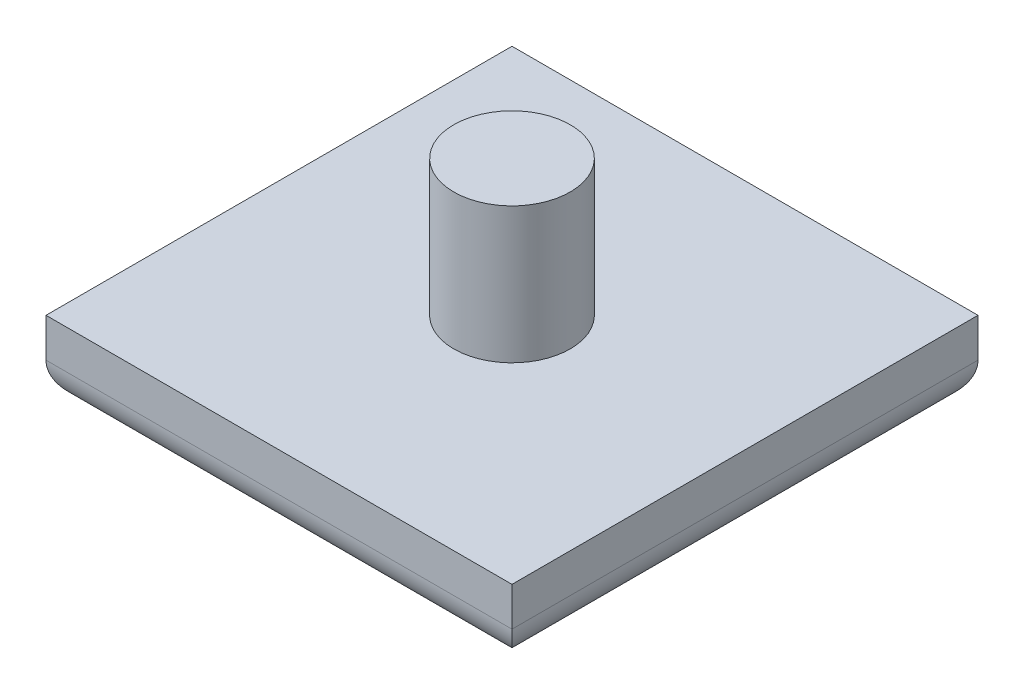
ISO-10303-21;
HEADER;
FILE_DESCRIPTION(('STEP AP214'),'2;1');
FILE_NAME('part.step','',(''),(''),'','','');
FILE_SCHEMA(('AUTOMOTIVE_DESIGN { 1 0 10303 214 1 1 1 1 }'));
ENDSEC;
DATA;
#1=APPLICATION_CONTEXT('core data for automotive mechanical design processes');
#2=APPLICATION_PROTOCOL_DEFINITION('international standard','automotive_design',2000,#1);
#3=PRODUCT_CONTEXT('',#1,'mechanical');
#4=PRODUCT('Part','Part','',(#3));
#5=PRODUCT_RELATED_PRODUCT_CATEGORY('part','',(#4));
#6=PRODUCT_DEFINITION_FORMATION('','',#4);
#7=PRODUCT_DEFINITION_CONTEXT('part definition',#1,'design');
#8=PRODUCT_DEFINITION('design','',#6,#7);
#9=PRODUCT_DEFINITION_SHAPE('','',#8);
#10=(LENGTH_UNIT() NAMED_UNIT(*) SI_UNIT(.MILLI.,.METRE.));
#11=(NAMED_UNIT(*) PLANE_ANGLE_UNIT() SI_UNIT($,.RADIAN.));
#12=(NAMED_UNIT(*) SI_UNIT($,.STERADIAN.) SOLID_ANGLE_UNIT());
#13=UNCERTAINTY_MEASURE_WITH_UNIT(LENGTH_MEASURE(1.E-05),#10,'distance_accuracy_value','');
#14=(GEOMETRIC_REPRESENTATION_CONTEXT(3) GLOBAL_UNCERTAINTY_ASSIGNED_CONTEXT((#13)) GLOBAL_UNIT_ASSIGNED_CONTEXT((#10,
#11,#12)) REPRESENTATION_CONTEXT('',''));
#15=CARTESIAN_POINT('',(0.,0.,0.));
#16=DIRECTION('',(0.,0.,1.));
#17=DIRECTION('',(1.,0.,0.));
#18=AXIS2_PLACEMENT_3D('',#15,#16,#17);
#19=CARTESIAN_POINT('',(15.24,5.08,-15.24));
#20=DIRECTION('',(-1.,0.,0.));
#21=DIRECTION('',(0.,0.,1.));
#22=AXIS2_PLACEMENT_3D('',#19,#20,#21);
#23=PLANE('',#22);
#24=DIRECTION('',(0.,-1.,0.));
#25=VECTOR('',#24,1.);
#26=CARTESIAN_POINT('',(15.24,5.08,15.24));
#27=LINE('',#26,#25);
#28=CARTESIAN_POINT('',(15.24,5.08,15.24));
#29=VERTEX_POINT('',#28);
#30=CARTESIAN_POINT('',(15.24,2.54,15.24));
#31=VERTEX_POINT('',#30);
#32=EDGE_CURVE('E180',#29,#31,#27,.T.);
#33=ORIENTED_EDGE('',*,*,#32,.T.);
#34=DIRECTION('',(0.,0.,-1.));
#35=VECTOR('',#34,1.);
#36=CARTESIAN_POINT('',(15.24,2.54,-15.24));
#37=LINE('',#36,#35);
#38=CARTESIAN_POINT('',(15.24,2.54,-15.24));
#39=VERTEX_POINT('',#38);
#40=EDGE_CURVE('E11',#31,#39,#37,.T.);
#41=ORIENTED_EDGE('',*,*,#40,.T.);
#42=DIRECTION('',(0.,-1.,0.));
#43=VECTOR('',#42,1.);
#44=CARTESIAN_POINT('',(15.24,5.08,-15.24));
#45=LINE('',#44,#43);
#46=CARTESIAN_POINT('',(15.24,5.08,-15.24));
#47=VERTEX_POINT('',#46);
#48=EDGE_CURVE('E101',#47,#39,#45,.T.);
#49=ORIENTED_EDGE('',*,*,#48,.F.);
#50=DIRECTION('',(0.,0.,-1.));
#51=VECTOR('',#50,1.);
#52=CARTESIAN_POINT('',(15.24,5.08,-15.24));
#53=LINE('',#52,#51);
#54=EDGE_CURVE('E108',#29,#47,#53,.T.);
#55=ORIENTED_EDGE('',*,*,#54,.F.);
#56=EDGE_LOOP('',(#33,#41,#49,#55));
#57=FACE_BOUND('',#56,.T.);
#58=ADVANCED_FACE('F39',(#57),#23,.F.);
#59=CARTESIAN_POINT('',(-15.24,5.08,-15.24));
#60=DIRECTION('',(0.,0.,1.));
#61=DIRECTION('',(1.,0.,0.));
#62=AXIS2_PLACEMENT_3D('',#59,#60,#61);
#63=PLANE('',#62);
#64=ORIENTED_EDGE('',*,*,#48,.T.);
#65=DIRECTION('',(-1.,0.,0.));
#66=VECTOR('',#65,1.);
#67=CARTESIAN_POINT('',(-15.24,2.54,-15.24));
#68=LINE('',#67,#66);
#69=CARTESIAN_POINT('',(-15.24,2.54,-15.24));
#70=VERTEX_POINT('',#69);
#71=EDGE_CURVE('E125',#39,#70,#68,.T.);
#72=ORIENTED_EDGE('',*,*,#71,.T.);
#73=DIRECTION('',(0.,-1.,0.));
#74=VECTOR('',#73,1.);
#75=CARTESIAN_POINT('',(-15.24,5.08,-15.24));
#76=LINE('',#75,#74);
#77=CARTESIAN_POINT('',(-15.24,5.08,-15.24));
#78=VERTEX_POINT('',#77);
#79=EDGE_CURVE('E103',#78,#70,#76,.T.);
#80=ORIENTED_EDGE('',*,*,#79,.F.);
#81=DIRECTION('',(-1.,0.,0.));
#82=VECTOR('',#81,1.);
#83=CARTESIAN_POINT('',(-15.24,5.08,-15.24));
#84=LINE('',#83,#82);
#85=EDGE_CURVE('E96',#47,#78,#84,.T.);
#86=ORIENTED_EDGE('',*,*,#85,.F.);
#87=EDGE_LOOP('',(#64,#72,#80,#86));
#88=FACE_BOUND('',#87,.T.);
#89=ADVANCED_FACE('F98',(#88),#63,.F.);
#90=CARTESIAN_POINT('',(-15.24,5.08,-15.24));
#91=DIRECTION('',(1.,0.,0.));
#92=DIRECTION('',(0.,0.,-1.));
#93=AXIS2_PLACEMENT_3D('',#90,#91,#92);
#94=PLANE('',#93);
#95=ORIENTED_EDGE('',*,*,#79,.T.);
#96=DIRECTION('',(0.,0.,1.));
#97=VECTOR('',#96,1.);
#98=CARTESIAN_POINT('',(-15.24,2.54,-15.24));
#99=LINE('',#98,#97);
#100=CARTESIAN_POINT('',(-15.24,2.54,15.24));
#101=VERTEX_POINT('',#100);
#102=EDGE_CURVE('E64',#70,#101,#99,.T.);
#103=ORIENTED_EDGE('',*,*,#102,.T.);
#104=DIRECTION('',(0.,-1.,0.));
#105=VECTOR('',#104,1.);
#106=CARTESIAN_POINT('',(-15.24,5.08,15.24));
#107=LINE('',#106,#105);
#108=CARTESIAN_POINT('',(-15.24,5.08,15.24));
#109=VERTEX_POINT('',#108);
#110=EDGE_CURVE('E127',#109,#101,#107,.T.);
#111=ORIENTED_EDGE('',*,*,#110,.F.);
#112=DIRECTION('',(0.,0.,1.));
#113=VECTOR('',#112,1.);
#114=CARTESIAN_POINT('',(-15.24,5.08,-15.24));
#115=LINE('',#114,#113);
#116=EDGE_CURVE('E107',#78,#109,#115,.T.);
#117=ORIENTED_EDGE('',*,*,#116,.F.);
#118=EDGE_LOOP('',(#95,#103,#111,#117));
#119=FACE_BOUND('',#118,.T.);
#120=ADVANCED_FACE('F192',(#119),#94,.F.);
#121=CARTESIAN_POINT('',(-15.24,5.08,15.24));
#122=DIRECTION('',(0.,0.,-1.));
#123=DIRECTION('',(-1.,0.,0.));
#124=AXIS2_PLACEMENT_3D('',#121,#122,#123);
#125=PLANE('',#124);
#126=ORIENTED_EDGE('',*,*,#110,.T.);
#127=DIRECTION('',(1.,0.,0.));
#128=VECTOR('',#127,1.);
#129=CARTESIAN_POINT('',(-15.24,2.54,15.24));
#130=LINE('',#129,#128);
#131=EDGE_CURVE('E49',#101,#31,#130,.T.);
#132=ORIENTED_EDGE('',*,*,#131,.T.);
#133=ORIENTED_EDGE('',*,*,#32,.F.);
#134=DIRECTION('',(1.,0.,0.));
#135=VECTOR('',#134,1.);
#136=CARTESIAN_POINT('',(-15.24,5.08,15.24));
#137=LINE('',#136,#135);
#138=EDGE_CURVE('E113',#109,#29,#137,.T.);
#139=ORIENTED_EDGE('',*,*,#138,.F.);
#140=EDGE_LOOP('',(#126,#132,#133,#139));
#141=FACE_BOUND('',#140,.T.);
#142=ADVANCED_FACE('F183',(#141),#125,.F.);
#143=CARTESIAN_POINT('',(0.,5.08,0.));
#144=DIRECTION('',(0.,1.,0.));
#145=DIRECTION('',(0.,0.,1.));
#146=AXIS2_PLACEMENT_3D('',#143,#144,#145);
#147=PLANE('',#146);
#148=CARTESIAN_POINT('',(0.,5.08,0.));
#149=DIRECTION('',(0.,1.,0.));
#150=DIRECTION('',(0.,0.,1.));
#151=AXIS2_PLACEMENT_3D('',#148,#149,#150);
#152=CIRCLE('',#151,3.81);
#153=CARTESIAN_POINT('',(0.,5.08,3.81));
#154=VERTEX_POINT('',#153);
#155=EDGE_CURVE('E120',#154,#154,#152,.T.);
#156=ORIENTED_EDGE('',*,*,#155,.F.);
#157=EDGE_LOOP('',(#156));
#158=FACE_BOUND('',#157,.T.);
#159=ORIENTED_EDGE('',*,*,#54,.T.);
#160=ORIENTED_EDGE('',*,*,#85,.T.);
#161=ORIENTED_EDGE('',*,*,#116,.T.);
#162=ORIENTED_EDGE('',*,*,#138,.T.);
#163=EDGE_LOOP('',(#159,#160,#161,#162));
#164=FACE_BOUND('',#163,.T.);
#165=ADVANCED_FACE('F111',(#158,#164),#147,.T.);
#166=CARTESIAN_POINT('',(0.,0.,0.));
#167=DIRECTION('',(0.,1.,0.));
#168=DIRECTION('',(0.,0.,1.));
#169=AXIS2_PLACEMENT_3D('',#166,#167,#168);
#170=PLANE('',#169);
#171=CARTESIAN_POINT('',(0.,0.,0.));
#172=DIRECTION('',(0.,-1.,0.));
#173=DIRECTION('',(0.,0.,-1.));
#174=AXIS2_PLACEMENT_3D('',#171,#172,#173);
#175=CIRCLE('',#174,2.54);
#176=CARTESIAN_POINT('',(0.,0.,-2.54));
#177=VERTEX_POINT('',#176);
#178=EDGE_CURVE('E173',#177,#177,#175,.T.);
#179=ORIENTED_EDGE('',*,*,#178,.F.);
#180=EDGE_LOOP('',(#179));
#181=FACE_BOUND('',#180,.T.);
#182=DIRECTION('',(0.,0.,1.));
#183=VECTOR('',#182,1.);
#184=CARTESIAN_POINT('',(-12.7,0.,0.));
#185=LINE('',#184,#183);
#186=CARTESIAN_POINT('',(-12.7,0.,12.7));
#187=VERTEX_POINT('',#186);
#188=CARTESIAN_POINT('',(-12.7,0.,-12.7));
#189=VERTEX_POINT('',#188);
#190=EDGE_CURVE('E139',#187,#189,#185,.F.);
#191=ORIENTED_EDGE('',*,*,#190,.T.);
#192=DIRECTION('',(-1.,0.,0.));
#193=VECTOR('',#192,1.);
#194=CARTESIAN_POINT('',(0.,0.,-12.7));
#195=LINE('',#194,#193);
#196=CARTESIAN_POINT('',(12.7,0.,-12.7));
#197=VERTEX_POINT('',#196);
#198=EDGE_CURVE('E142',#189,#197,#195,.F.);
#199=ORIENTED_EDGE('',*,*,#198,.T.);
#200=DIRECTION('',(0.,0.,-1.));
#201=VECTOR('',#200,1.);
#202=CARTESIAN_POINT('',(12.7,0.,0.));
#203=LINE('',#202,#201);
#204=CARTESIAN_POINT('',(12.7,0.,12.7));
#205=VERTEX_POINT('',#204);
#206=EDGE_CURVE('E133',#197,#205,#203,.F.);
#207=ORIENTED_EDGE('',*,*,#206,.T.);
#208=DIRECTION('',(1.,0.,0.));
#209=VECTOR('',#208,1.);
#210=CARTESIAN_POINT('',(0.,0.,12.7));
#211=LINE('',#210,#209);
#212=EDGE_CURVE('E136',#205,#187,#211,.F.);
#213=ORIENTED_EDGE('',*,*,#212,.T.);
#214=EDGE_LOOP('',(#191,#199,#207,#213));
#215=FACE_BOUND('',#214,.T.);
#216=ADVANCED_FACE('F224',(#181,#215),#170,.F.);
#217=CARTESIAN_POINT('',(0.,13.97,0.));
#218=DIRECTION('',(0.,-1.,0.));
#219=DIRECTION('',(0.,0.,-1.));
#220=AXIS2_PLACEMENT_3D('',#217,#218,#219);
#221=CYLINDRICAL_SURFACE('',#220,3.81);
#222=CARTESIAN_POINT('',(0.,13.97,0.));
#223=DIRECTION('',(0.,1.,0.));
#224=DIRECTION('',(0.,0.,1.));
#225=AXIS2_PLACEMENT_3D('',#222,#223,#224);
#226=CIRCLE('',#225,3.81);
#227=CARTESIAN_POINT('',(0.,13.97,3.81));
#228=VERTEX_POINT('',#227);
#229=EDGE_CURVE('E116',#228,#228,#226,.T.);
#230=ORIENTED_EDGE('',*,*,#229,.F.);
#231=EDGE_LOOP('',(#230));
#232=FACE_BOUND('',#231,.T.);
#233=ORIENTED_EDGE('',*,*,#155,.T.);
#234=EDGE_LOOP('',(#233));
#235=FACE_BOUND('',#234,.T.);
#236=ADVANCED_FACE('F220',(#232,#235),#221,.T.);
#237=CARTESIAN_POINT('',(0.,13.97,0.));
#238=DIRECTION('',(0.,1.,0.));
#239=DIRECTION('',(0.,0.,1.));
#240=AXIS2_PLACEMENT_3D('',#237,#238,#239);
#241=PLANE('',#240);
#242=ORIENTED_EDGE('',*,*,#229,.T.);
#243=EDGE_LOOP('',(#242));
#244=FACE_BOUND('',#243,.T.);
#245=ADVANCED_FACE('F216',(#244),#241,.T.);
#246=CARTESIAN_POINT('',(-15.24,2.54,12.7));
#247=DIRECTION('',(1.,0.,0.));
#248=DIRECTION('',(0.,0.,-1.));
#249=AXIS2_PLACEMENT_3D('',#246,#247,#248);
#250=CYLINDRICAL_SURFACE('',#249,2.54);
#251=CARTESIAN_POINT('',(-12.7,2.54,12.7));
#252=DIRECTION('',(0.707106781186548,0.,0.707106781186547));
#253=DIRECTION('',(0.707106781186547,0.,-0.707106781186548));
#254=AXIS2_PLACEMENT_3D('',#251,#252,#253);
#255=ELLIPSE('',#254,3.59210244842766,2.54);
#256=EDGE_CURVE('E156',#187,#101,#255,.F.);
#257=ORIENTED_EDGE('',*,*,#256,.F.);
#258=ORIENTED_EDGE('',*,*,#212,.F.);
#259=CARTESIAN_POINT('',(12.7,2.54,12.7));
#260=DIRECTION('',(0.707106781186547,0.,-0.707106781186548));
#261=DIRECTION('',(-0.707106781186548,0.,-0.707106781186547));
#262=AXIS2_PLACEMENT_3D('',#259,#260,#261);
#263=ELLIPSE('',#262,3.59210244842766,2.54);
#264=EDGE_CURVE('E43',#31,#205,#263,.T.);
#265=ORIENTED_EDGE('',*,*,#264,.F.);
#266=ORIENTED_EDGE('',*,*,#131,.F.);
#267=EDGE_LOOP('',(#257,#258,#265,#266));
#268=FACE_BOUND('',#267,.T.);
#269=ADVANCED_FACE('F41',(#268),#250,.T.);
#270=CARTESIAN_POINT('',(12.7,2.54,-15.24));
#271=DIRECTION('',(0.,0.,-1.));
#272=DIRECTION('',(-1.,0.,0.));
#273=AXIS2_PLACEMENT_3D('',#270,#271,#272);
#274=CYLINDRICAL_SURFACE('',#273,2.54);
#275=ORIENTED_EDGE('',*,*,#264,.T.);
#276=ORIENTED_EDGE('',*,*,#206,.F.);
#277=CARTESIAN_POINT('',(12.7,2.54,-12.7));
#278=DIRECTION('',(-0.707106781186548,0.,-0.707106781186547));
#279=DIRECTION('',(0.707106781186547,0.,-0.707106781186548));
#280=AXIS2_PLACEMENT_3D('',#277,#278,#279);
#281=ELLIPSE('',#280,3.59210244842766,2.54);
#282=EDGE_CURVE('E153',#39,#197,#281,.T.);
#283=ORIENTED_EDGE('',*,*,#282,.F.);
#284=ORIENTED_EDGE('',*,*,#40,.F.);
#285=EDGE_LOOP('',(#275,#276,#283,#284));
#286=FACE_BOUND('',#285,.T.);
#287=ADVANCED_FACE('F186',(#286),#274,.T.);
#288=CARTESIAN_POINT('',(-12.7,2.54,-15.24));
#289=DIRECTION('',(0.,0.,1.));
#290=DIRECTION('',(1.,0.,0.));
#291=AXIS2_PLACEMENT_3D('',#288,#289,#290);
#292=CYLINDRICAL_SURFACE('',#291,2.54);
#293=ORIENTED_EDGE('',*,*,#256,.T.);
#294=ORIENTED_EDGE('',*,*,#102,.F.);
#295=CARTESIAN_POINT('',(-12.7,2.54,-12.7));
#296=DIRECTION('',(-0.707106781186547,0.,0.707106781186548));
#297=DIRECTION('',(0.707106781186548,0.,0.707106781186547));
#298=AXIS2_PLACEMENT_3D('',#295,#296,#297);
#299=ELLIPSE('',#298,3.59210244842766,2.54);
#300=EDGE_CURVE('E150',#189,#70,#299,.F.);
#301=ORIENTED_EDGE('',*,*,#300,.F.);
#302=ORIENTED_EDGE('',*,*,#190,.F.);
#303=EDGE_LOOP('',(#293,#294,#301,#302));
#304=FACE_BOUND('',#303,.T.);
#305=ADVANCED_FACE('F210',(#304),#292,.T.);
#306=CARTESIAN_POINT('',(-15.24,2.54,-12.7));
#307=DIRECTION('',(-1.,0.,0.));
#308=DIRECTION('',(0.,0.,1.));
#309=AXIS2_PLACEMENT_3D('',#306,#307,#308);
#310=CYLINDRICAL_SURFACE('',#309,2.54);
#311=ORIENTED_EDGE('',*,*,#282,.T.);
#312=ORIENTED_EDGE('',*,*,#198,.F.);
#313=ORIENTED_EDGE('',*,*,#300,.T.);
#314=ORIENTED_EDGE('',*,*,#71,.F.);
#315=EDGE_LOOP('',(#311,#312,#313,#314));
#316=FACE_BOUND('',#315,.T.);
#317=ADVANCED_FACE('F190',(#316),#310,.T.);
#318=CARTESIAN_POINT('',(0.,12.7,0.));
#319=DIRECTION('',(0.,-1.,0.));
#320=DIRECTION('',(0.,0.,-1.));
#321=AXIS2_PLACEMENT_3D('',#318,#319,#320);
#322=CYLINDRICAL_SURFACE('',#321,2.54);
#323=CARTESIAN_POINT('',(0.,12.7,0.));
#324=DIRECTION('',(0.,-1.,0.));
#325=DIRECTION('',(0.,0.,-1.));
#326=AXIS2_PLACEMENT_3D('',#323,#324,#325);
#327=CIRCLE('',#326,2.54);
#328=CARTESIAN_POINT('',(0.,12.7,-2.54));
#329=VERTEX_POINT('',#328);
#330=EDGE_CURVE('E154',#329,#329,#327,.T.);
#331=ORIENTED_EDGE('',*,*,#330,.F.);
#332=EDGE_LOOP('',(#331));
#333=FACE_BOUND('',#332,.T.);
#334=ORIENTED_EDGE('',*,*,#178,.T.);
#335=EDGE_LOOP('',(#334));
#336=FACE_BOUND('',#335,.T.);
#337=ADVANCED_FACE('F209',(#333,#336),#322,.F.);
#338=CARTESIAN_POINT('',(0.,12.7,0.));
#339=DIRECTION('',(0.,-1.,0.));
#340=DIRECTION('',(0.,0.,-1.));
#341=AXIS2_PLACEMENT_3D('',#338,#339,#340);
#342=PLANE('',#341);
#343=ORIENTED_EDGE('',*,*,#330,.T.);
#344=EDGE_LOOP('',(#343));
#345=FACE_BOUND('',#344,.T.);
#346=ADVANCED_FACE('F248',(#345),#342,.T.);
#347=CLOSED_SHELL('',(#58,#89,#120,#142,#165,#216,#236,#245,#269,#287,#305,#317,#337,#346));
#348=MANIFOLD_SOLID_BREP('B2',#347);
#349=ADVANCED_BREP_SHAPE_REPRESENTATION('',(#18,#348),#14);
#350=SHAPE_DEFINITION_REPRESENTATION(#9,#349);
ENDSEC;
END-ISO-10303-21;
